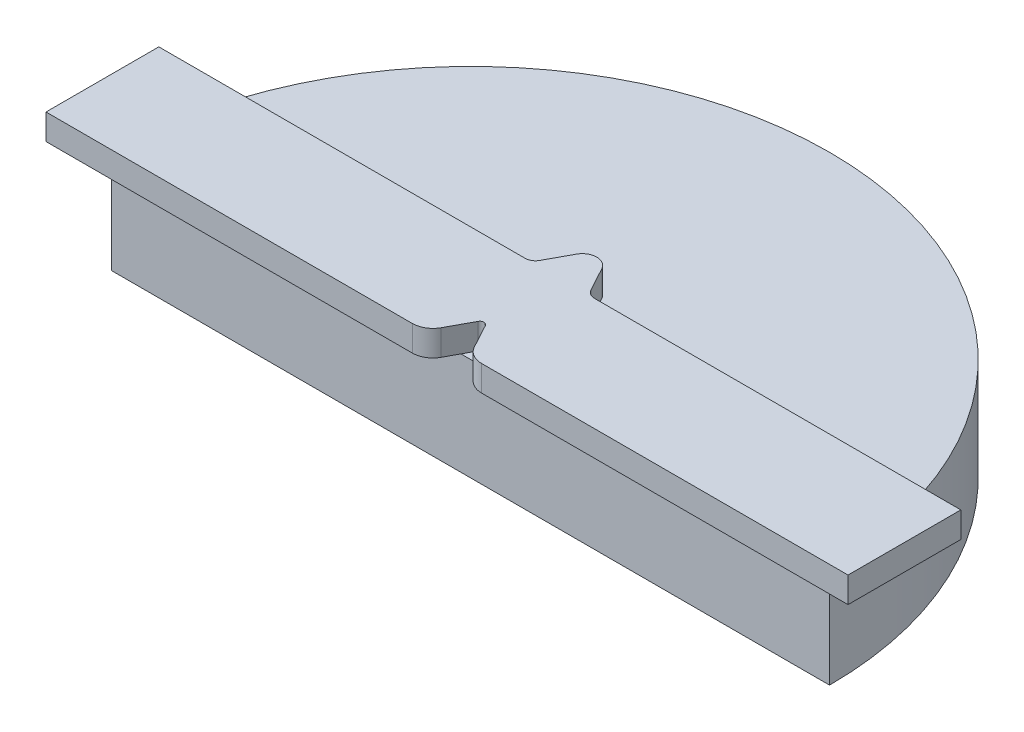
ISO-10303-21;
HEADER;
FILE_DESCRIPTION(('STEP AP214'),'2;1');
FILE_NAME('part.step','',(''),(''),'','','');
FILE_SCHEMA(('AUTOMOTIVE_DESIGN { 1 0 10303 214 1 1 1 1 }'));
ENDSEC;
DATA;
#1=APPLICATION_CONTEXT('core data for automotive mechanical design processes');
#2=APPLICATION_PROTOCOL_DEFINITION('international standard','automotive_design',2000,#1);
#3=PRODUCT_CONTEXT('',#1,'mechanical');
#4=PRODUCT('Part','Part','',(#3));
#5=PRODUCT_RELATED_PRODUCT_CATEGORY('part','',(#4));
#6=PRODUCT_DEFINITION_FORMATION('','',#4);
#7=PRODUCT_DEFINITION_CONTEXT('part definition',#1,'design');
#8=PRODUCT_DEFINITION('design','',#6,#7);
#9=PRODUCT_DEFINITION_SHAPE('','',#8);
#10=(LENGTH_UNIT() NAMED_UNIT(*) SI_UNIT(.MILLI.,.METRE.));
#11=(NAMED_UNIT(*) PLANE_ANGLE_UNIT() SI_UNIT($,.RADIAN.));
#12=(NAMED_UNIT(*) SI_UNIT($,.STERADIAN.) SOLID_ANGLE_UNIT());
#13=UNCERTAINTY_MEASURE_WITH_UNIT(LENGTH_MEASURE(1.E-05),#10,'distance_accuracy_value','');
#14=(GEOMETRIC_REPRESENTATION_CONTEXT(3) GLOBAL_UNCERTAINTY_ASSIGNED_CONTEXT((#13)) GLOBAL_UNIT_ASSIGNED_CONTEXT((#10,
#11,#12)) REPRESENTATION_CONTEXT('',''));
#15=CARTESIAN_POINT('',(0.,0.,0.));
#16=DIRECTION('',(0.,0.,1.));
#17=DIRECTION('',(1.,0.,0.));
#18=AXIS2_PLACEMENT_3D('',#15,#16,#17);
#19=CARTESIAN_POINT('',(88.9,25.4,0.));
#20=DIRECTION('',(0.,-1.,0.));
#21=DIRECTION('',(0.,0.,-1.));
#22=AXIS2_PLACEMENT_3D('',#19,#20,#21);
#23=PLANE('',#22);
#24=CARTESIAN_POINT('',(97.4834626022666,25.4,-24.638));
#25=DIRECTION('',(0.,1.,0.));
#26=DIRECTION('',(0.,0.,1.));
#27=AXIS2_PLACEMENT_3D('',#24,#25,#26);
#28=CIRCLE('',#27,2.54);
#29=CARTESIAN_POINT('',(95.2499999999999,25.4,-23.4283534382819));
#30=VERTEX_POINT('',#29);
#31=CARTESIAN_POINT('',(97.4834626022666,25.4,-22.098));
#32=VERTEX_POINT('',#31);
#33=EDGE_CURVE('E223',#30,#32,#28,.T.);
#34=ORIENTED_EDGE('',*,*,#33,.T.);
#35=DIRECTION('',(1.,0.,0.));
#36=VECTOR('',#35,1.);
#37=CARTESIAN_POINT('',(97.4834626022666,25.4,-22.098));
#38=LINE('',#37,#36);
#39=CARTESIAN_POINT('',(175.00974623119,25.4,-22.098));
#40=VERTEX_POINT('',#39);
#41=EDGE_CURVE('E220',#32,#40,#38,.T.);
#42=ORIENTED_EDGE('',*,*,#41,.T.);
#43=CARTESIAN_POINT('',(88.9,25.4,0.));
#44=DIRECTION('',(0.,1.,0.));
#45=DIRECTION('',(0.,0.,-1.));
#46=AXIS2_PLACEMENT_3D('',#43,#44,#45);
#47=CIRCLE('',#46,88.9);
#48=CARTESIAN_POINT('',(2.79025376880966,25.4,-22.098));
#49=VERTEX_POINT('',#48);
#50=EDGE_CURVE('E312',#40,#49,#47,.T.);
#51=ORIENTED_EDGE('',*,*,#50,.T.);
#52=DIRECTION('',(1.,0.,0.));
#53=VECTOR('',#52,1.);
#54=CARTESIAN_POINT('',(-10.414,25.4,-22.098));
#55=LINE('',#54,#53);
#56=CARTESIAN_POINT('',(80.3165373977333,25.4,-22.098));
#57=VERTEX_POINT('',#56);
#58=EDGE_CURVE('E202',#49,#57,#55,.T.);
#59=ORIENTED_EDGE('',*,*,#58,.T.);
#60=CARTESIAN_POINT('',(80.3165373977333,25.4,-24.638));
#61=DIRECTION('',(0.,1.,0.));
#62=DIRECTION('',(0.,0.,-1.));
#63=AXIS2_PLACEMENT_3D('',#60,#61,#62);
#64=CIRCLE('',#63,2.54);
#65=CARTESIAN_POINT('',(82.5499999999999,25.4,-23.4283534382819));
#66=VERTEX_POINT('',#65);
#67=EDGE_CURVE('E236',#57,#66,#64,.T.);
#68=ORIENTED_EDGE('',*,*,#67,.T.);
#69=DIRECTION('',(0.476238803826023,0.,-0.879315985144339));
#70=VECTOR('',#69,1.);
#71=CARTESIAN_POINT('',(85.7731523568267,25.4,-29.3795051864053));
#72=LINE('',#71,#70);
#73=CARTESIAN_POINT('',(85.7731523568267,25.4,-29.3795051864053));
#74=VERTEX_POINT('',#73);
#75=EDGE_CURVE('E233',#66,#74,#72,.T.);
#76=ORIENTED_EDGE('',*,*,#75,.T.);
#77=CARTESIAN_POINT('',(88.9,25.4,-27.686));
#78=DIRECTION('',(0.,-1.,0.));
#79=DIRECTION('',(0.,0.,1.));
#80=AXIS2_PLACEMENT_3D('',#77,#78,#79);
#81=CIRCLE('',#80,3.556);
#82=CARTESIAN_POINT('',(92.0268476431733,25.4,-29.3795051864053));
#83=VERTEX_POINT('',#82);
#84=EDGE_CURVE('E230',#74,#83,#81,.T.);
#85=ORIENTED_EDGE('',*,*,#84,.T.);
#86=DIRECTION('',(0.476238803826009,0.,0.879315985144346));
#87=VECTOR('',#86,1.);
#88=CARTESIAN_POINT('',(92.0268476431733,25.4,-29.3795051864053));
#89=LINE('',#88,#87);
#90=EDGE_CURVE('E227',#83,#30,#89,.T.);
#91=ORIENTED_EDGE('',*,*,#90,.T.);
#92=EDGE_LOOP('',(#34,#42,#51,#59,#68,#76,#85,#91));
#93=FACE_BOUND('',#92,.T.);
#94=ADVANCED_FACE('F33',(#93),#23,.F.);
#95=DIRECTION('',(0.476238803826009,0.,0.879315985144346));
#96=VECTOR('',#95,1.);
#97=CARTESIAN_POINT('',(89.7933850409066,25.4,-2.76985862468723));
#98=LINE('',#97,#96);
#99=CARTESIAN_POINT('',(89.7933850409066,25.4,-2.76985862468723));
#100=VERTEX_POINT('',#99);
#101=CARTESIAN_POINT('',(91.2935444608126,25.4,0.));
#102=VERTEX_POINT('',#101);
#103=EDGE_CURVE('E283',#100,#102,#98,.T.);
#104=ORIENTED_EDGE('',*,*,#103,.F.);
#105=CARTESIAN_POINT('',(88.9,25.4,-2.286));
#106=DIRECTION('',(0.,1.,0.));
#107=DIRECTION('',(1.,0.,0.));
#108=AXIS2_PLACEMENT_3D('',#105,#106,#107);
#109=CIRCLE('',#108,1.016);
#110=CARTESIAN_POINT('',(88.0066149590933,25.4,-2.76985862468724));
#111=VERTEX_POINT('',#110);
#112=EDGE_CURVE('E280',#111,#100,#109,.F.);
#113=ORIENTED_EDGE('',*,*,#112,.F.);
#114=DIRECTION('',(0.476238803826023,0.,-0.879315985144339));
#115=VECTOR('',#114,1.);
#116=CARTESIAN_POINT('',(88.0066149590933,25.4,-2.76985862468724));
#117=LINE('',#116,#115);
#118=CARTESIAN_POINT('',(86.5064555391873,25.4,0.));
#119=VERTEX_POINT('',#118);
#120=EDGE_CURVE('E11',#119,#111,#117,.T.);
#121=ORIENTED_EDGE('',*,*,#120,.F.);
#122=DIRECTION('',(1.,0.,0.));
#123=VECTOR('',#122,1.);
#124=CARTESIAN_POINT('',(0.,25.4,0.));
#125=LINE('',#124,#123);
#126=EDGE_CURVE('E316',#119,#102,#125,.T.);
#127=ORIENTED_EDGE('',*,*,#126,.T.);
#128=EDGE_LOOP('',(#104,#113,#121,#127));
#129=FACE_BOUND('',#128,.T.);
#130=ADVANCED_FACE('F338',(#129),#23,.F.);
#131=CARTESIAN_POINT('',(88.9,25.4,0.));
#132=DIRECTION('',(0.,-1.,0.));
#133=DIRECTION('',(0.,0.,-1.));
#134=AXIS2_PLACEMENT_3D('',#131,#132,#133);
#135=CYLINDRICAL_SURFACE('',#134,88.9);
#136=CARTESIAN_POINT('',(88.9,0.,0.));
#137=DIRECTION('',(0.,1.,0.));
#138=DIRECTION('',(0.,0.,-1.));
#139=AXIS2_PLACEMENT_3D('',#136,#137,#138);
#140=CIRCLE('',#139,88.9);
#141=CARTESIAN_POINT('',(177.8,0.,0.));
#142=VERTEX_POINT('',#141);
#143=CARTESIAN_POINT('',(0.,0.,0.));
#144=VERTEX_POINT('',#143);
#145=EDGE_CURVE('E308',#142,#144,#140,.T.);
#146=ORIENTED_EDGE('',*,*,#145,.T.);
#147=DIRECTION('',(0.,-1.,0.));
#148=VECTOR('',#147,1.);
#149=CARTESIAN_POINT('',(0.,25.4,0.));
#150=LINE('',#149,#148);
#151=CARTESIAN_POINT('',(0.,25.4,0.));
#152=VERTEX_POINT('',#151);
#153=EDGE_CURVE('E37',#152,#144,#150,.T.);
#154=ORIENTED_EDGE('',*,*,#153,.F.);
#155=CARTESIAN_POINT('',(88.9,25.4,0.));
#156=DIRECTION('',(0.,1.,0.));
#157=DIRECTION('',(0.,0.,1.));
#158=AXIS2_PLACEMENT_3D('',#155,#156,#157);
#159=CIRCLE('',#158,88.9);
#160=EDGE_CURVE('E191',#49,#152,#159,.T.);
#161=ORIENTED_EDGE('',*,*,#160,.F.);
#162=ORIENTED_EDGE('',*,*,#50,.F.);
#163=CARTESIAN_POINT('',(177.8,25.4,0.));
#164=VERTEX_POINT('',#163);
#165=EDGE_CURVE('E309',#164,#40,#47,.T.);
#166=ORIENTED_EDGE('',*,*,#165,.F.);
#167=DIRECTION('',(0.,-1.,0.));
#168=VECTOR('',#167,1.);
#169=CARTESIAN_POINT('',(177.8,25.4,0.));
#170=LINE('',#169,#168);
#171=EDGE_CURVE('E315',#164,#142,#170,.T.);
#172=ORIENTED_EDGE('',*,*,#171,.T.);
#173=EDGE_LOOP('',(#146,#154,#161,#162,#166,#172));
#174=FACE_BOUND('',#173,.T.);
#175=ADVANCED_FACE('F35',(#174),#135,.T.);
#176=CARTESIAN_POINT('',(0.,25.4,0.));
#177=DIRECTION('',(0.,0.,-1.));
#178=DIRECTION('',(-1.,0.,0.));
#179=AXIS2_PLACEMENT_3D('',#176,#177,#178);
#180=PLANE('',#179);
#181=DIRECTION('',(1.,0.,0.));
#182=VECTOR('',#181,1.);
#183=CARTESIAN_POINT('',(0.,0.,0.));
#184=LINE('',#183,#182);
#185=EDGE_CURVE('E50',#144,#142,#184,.T.);
#186=ORIENTED_EDGE('',*,*,#185,.T.);
#187=ORIENTED_EDGE('',*,*,#171,.F.);
#188=EDGE_CURVE('E311',#102,#164,#125,.T.);
#189=ORIENTED_EDGE('',*,*,#188,.F.);
#190=ORIENTED_EDGE('',*,*,#126,.F.);
#191=EDGE_CURVE('E313',#152,#119,#125,.T.);
#192=ORIENTED_EDGE('',*,*,#191,.F.);
#193=ORIENTED_EDGE('',*,*,#153,.T.);
#194=EDGE_LOOP('',(#186,#187,#189,#190,#192,#193));
#195=FACE_BOUND('',#194,.T.);
#196=ADVANCED_FACE('F323',(#195),#180,.F.);
#197=CARTESIAN_POINT('',(88.9,0.,0.));
#198=DIRECTION('',(0.,-1.,0.));
#199=DIRECTION('',(0.,0.,-1.));
#200=AXIS2_PLACEMENT_3D('',#197,#198,#199);
#201=PLANE('',#200);
#202=ORIENTED_EDGE('',*,*,#145,.F.);
#203=ORIENTED_EDGE('',*,*,#185,.F.);
#204=EDGE_LOOP('',(#202,#203));
#205=FACE_BOUND('',#204,.T.);
#206=ADVANCED_FACE('F325',(#205),#201,.T.);
#207=CARTESIAN_POINT('',(97.4834626022666,25.4,0.761999999999999));
#208=DIRECTION('',(0.,1.,0.));
#209=DIRECTION('',(1.,0.,0.));
#210=AXIS2_PLACEMENT_3D('',#207,#208,#209);
#211=PLANE('',#210);
#212=ORIENTED_EDGE('',*,*,#191,.T.);
#213=CARTESIAN_POINT('',(84.7834626022666,25.4,3.1812931234362));
#214=VERTEX_POINT('',#213);
#215=EDGE_CURVE('E43',#214,#119,#117,.T.);
#216=ORIENTED_EDGE('',*,*,#215,.F.);
#217=CARTESIAN_POINT('',(80.3165373977333,25.4,0.761999999999999));
#218=DIRECTION('',(0.,1.,0.));
#219=DIRECTION('',(1.,0.,0.));
#220=AXIS2_PLACEMENT_3D('',#217,#218,#219);
#221=CIRCLE('',#220,5.08);
#222=CARTESIAN_POINT('',(80.3165373977333,25.4,5.842));
#223=VERTEX_POINT('',#222);
#224=EDGE_CURVE('E277',#223,#214,#221,.T.);
#225=ORIENTED_EDGE('',*,*,#224,.F.);
#226=DIRECTION('',(1.,0.,0.));
#227=VECTOR('',#226,1.);
#228=CARTESIAN_POINT('',(-10.414,25.4,5.842));
#229=LINE('',#228,#227);
#230=CARTESIAN_POINT('',(-10.414,25.4,5.842));
#231=VERTEX_POINT('',#230);
#232=EDGE_CURVE('E275',#231,#223,#229,.T.);
#233=ORIENTED_EDGE('',*,*,#232,.F.);
#234=DIRECTION('',(0.,0.,-1.));
#235=VECTOR('',#234,1.);
#236=CARTESIAN_POINT('',(-10.414,25.4,5.842));
#237=LINE('',#236,#235);
#238=CARTESIAN_POINT('',(-10.414,25.4,-22.098));
#239=VERTEX_POINT('',#238);
#240=EDGE_CURVE('E273',#231,#239,#237,.T.);
#241=ORIENTED_EDGE('',*,*,#240,.T.);
#242=EDGE_CURVE('E197',#239,#49,#55,.T.);
#243=ORIENTED_EDGE('',*,*,#242,.T.);
#244=ORIENTED_EDGE('',*,*,#160,.T.);
#245=EDGE_LOOP('',(#212,#216,#225,#233,#241,#243,#244));
#246=FACE_BOUND('',#245,.T.);
#247=ADVANCED_FACE('F327',(#246),#211,.F.);
#248=DIRECTION('',(0.,0.,1.));
#249=VECTOR('',#248,1.);
#250=CARTESIAN_POINT('',(188.214,25.4,3.302));
#251=LINE('',#250,#249);
#252=CARTESIAN_POINT('',(188.214,25.4,-22.098));
#253=VERTEX_POINT('',#252);
#254=CARTESIAN_POINT('',(188.214,25.4,5.842));
#255=VERTEX_POINT('',#254);
#256=EDGE_CURVE('E187',#253,#255,#251,.T.);
#257=ORIENTED_EDGE('',*,*,#256,.T.);
#258=DIRECTION('',(1.,0.,0.));
#259=VECTOR('',#258,1.);
#260=CARTESIAN_POINT('',(97.4834626022666,25.4,5.842));
#261=LINE('',#260,#259);
#262=CARTESIAN_POINT('',(97.4834626022666,25.4,5.842));
#263=VERTEX_POINT('',#262);
#264=EDGE_CURVE('E253',#263,#255,#261,.T.);
#265=ORIENTED_EDGE('',*,*,#264,.F.);
#266=CARTESIAN_POINT('',(97.4834626022666,25.4,0.761999999999999));
#267=DIRECTION('',(0.,1.,0.));
#268=DIRECTION('',(1.,0.,0.));
#269=AXIS2_PLACEMENT_3D('',#266,#267,#268);
#270=CIRCLE('',#269,5.08);
#271=CARTESIAN_POINT('',(93.0165373977333,25.4,3.18129312343612));
#272=VERTEX_POINT('',#271);
#273=EDGE_CURVE('E254',#272,#263,#270,.T.);
#274=ORIENTED_EDGE('',*,*,#273,.F.);
#275=EDGE_CURVE('E282',#102,#272,#98,.T.);
#276=ORIENTED_EDGE('',*,*,#275,.F.);
#277=ORIENTED_EDGE('',*,*,#188,.T.);
#278=ORIENTED_EDGE('',*,*,#165,.T.);
#279=EDGE_CURVE('E224',#40,#253,#38,.T.);
#280=ORIENTED_EDGE('',*,*,#279,.T.);
#281=EDGE_LOOP('',(#257,#265,#274,#276,#277,#278,#280));
#282=FACE_BOUND('',#281,.T.);
#283=ADVANCED_FACE('F333',(#282),#211,.F.);
#284=CARTESIAN_POINT('',(97.4834626022666,31.75,5.842));
#285=DIRECTION('',(0.,0.,-1.));
#286=DIRECTION('',(-1.,0.,0.));
#287=AXIS2_PLACEMENT_3D('',#284,#285,#286);
#288=PLANE('',#287);
#289=ORIENTED_EDGE('',*,*,#264,.T.);
#290=DIRECTION('',(0.,-1.,0.));
#291=VECTOR('',#290,1.);
#292=CARTESIAN_POINT('',(188.214,31.75,5.842));
#293=LINE('',#292,#291);
#294=CARTESIAN_POINT('',(188.214,31.75,5.842));
#295=VERTEX_POINT('',#294);
#296=EDGE_CURVE('E306',#295,#255,#293,.T.);
#297=ORIENTED_EDGE('',*,*,#296,.F.);
#298=DIRECTION('',(1.,0.,0.));
#299=VECTOR('',#298,1.);
#300=CARTESIAN_POINT('',(97.4834626022666,31.75,5.842));
#301=LINE('',#300,#299);
#302=CARTESIAN_POINT('',(97.4834626022666,31.75,5.842));
#303=VERTEX_POINT('',#302);
#304=EDGE_CURVE('E178',#303,#295,#301,.T.);
#305=ORIENTED_EDGE('',*,*,#304,.F.);
#306=DIRECTION('',(0.,-1.,0.));
#307=VECTOR('',#306,1.);
#308=CARTESIAN_POINT('',(97.4834626022666,31.75,5.842));
#309=LINE('',#308,#307);
#310=EDGE_CURVE('E269',#303,#263,#309,.T.);
#311=ORIENTED_EDGE('',*,*,#310,.T.);
#312=EDGE_LOOP('',(#289,#297,#305,#311));
#313=FACE_BOUND('',#312,.T.);
#314=ADVANCED_FACE('F345',(#313),#288,.F.);
#315=CARTESIAN_POINT('',(188.214,31.75,3.302));
#316=DIRECTION('',(1.,0.,0.));
#317=DIRECTION('',(0.,0.,-1.));
#318=AXIS2_PLACEMENT_3D('',#315,#316,#317);
#319=PLANE('',#318);
#320=DIRECTION('',(0.,0.,1.));
#321=VECTOR('',#320,1.);
#322=CARTESIAN_POINT('',(188.214,31.75,3.302));
#323=LINE('',#322,#321);
#324=CARTESIAN_POINT('',(188.214,31.75,-22.098));
#325=VERTEX_POINT('',#324);
#326=EDGE_CURVE('E170',#325,#295,#323,.T.);
#327=ORIENTED_EDGE('',*,*,#326,.T.);
#328=ORIENTED_EDGE('',*,*,#296,.T.);
#329=ORIENTED_EDGE('',*,*,#256,.F.);
#330=DIRECTION('',(0.,-1.,0.));
#331=VECTOR('',#330,1.);
#332=CARTESIAN_POINT('',(188.214,31.75,-22.098));
#333=LINE('',#332,#331);
#334=EDGE_CURVE('E185',#325,#253,#333,.T.);
#335=ORIENTED_EDGE('',*,*,#334,.F.);
#336=EDGE_LOOP('',(#327,#328,#329,#335));
#337=FACE_BOUND('',#336,.T.);
#338=ADVANCED_FACE('F186',(#337),#319,.T.);
#339=CARTESIAN_POINT('',(-10.414,31.75,5.842));
#340=DIRECTION('',(-1.,0.,0.));
#341=DIRECTION('',(0.,0.,1.));
#342=AXIS2_PLACEMENT_3D('',#339,#340,#341);
#343=PLANE('',#342);
#344=DIRECTION('',(0.,-1.,0.));
#345=VECTOR('',#344,1.);
#346=CARTESIAN_POINT('',(-10.414,31.75,-22.098));
#347=LINE('',#346,#345);
#348=CARTESIAN_POINT('',(-10.414,31.75,-22.098));
#349=VERTEX_POINT('',#348);
#350=EDGE_CURVE('E219',#349,#239,#347,.T.);
#351=ORIENTED_EDGE('',*,*,#350,.T.);
#352=ORIENTED_EDGE('',*,*,#240,.F.);
#353=DIRECTION('',(0.,-1.,0.));
#354=VECTOR('',#353,1.);
#355=CARTESIAN_POINT('',(-10.414,31.75,5.842));
#356=LINE('',#355,#354);
#357=CARTESIAN_POINT('',(-10.414,31.75,5.842));
#358=VERTEX_POINT('',#357);
#359=EDGE_CURVE('E304',#358,#231,#356,.T.);
#360=ORIENTED_EDGE('',*,*,#359,.F.);
#361=DIRECTION('',(0.,0.,-1.));
#362=VECTOR('',#361,1.);
#363=CARTESIAN_POINT('',(-10.414,31.75,5.842));
#364=LINE('',#363,#362);
#365=EDGE_CURVE('E182',#358,#349,#364,.T.);
#366=ORIENTED_EDGE('',*,*,#365,.T.);
#367=EDGE_LOOP('',(#351,#352,#360,#366));
#368=FACE_BOUND('',#367,.T.);
#369=ADVANCED_FACE('F351',(#368),#343,.T.);
#370=CARTESIAN_POINT('',(-10.414,31.75,5.842));
#371=DIRECTION('',(0.,0.,-1.));
#372=DIRECTION('',(-1.,0.,0.));
#373=AXIS2_PLACEMENT_3D('',#370,#371,#372);
#374=PLANE('',#373);
#375=ORIENTED_EDGE('',*,*,#232,.T.);
#376=DIRECTION('',(0.,-1.,0.));
#377=VECTOR('',#376,1.);
#378=CARTESIAN_POINT('',(80.3165373977333,31.75,5.842));
#379=LINE('',#378,#377);
#380=CARTESIAN_POINT('',(80.3165373977333,31.75,5.842));
#381=VERTEX_POINT('',#380);
#382=EDGE_CURVE('E301',#381,#223,#379,.T.);
#383=ORIENTED_EDGE('',*,*,#382,.F.);
#384=DIRECTION('',(1.,0.,0.));
#385=VECTOR('',#384,1.);
#386=CARTESIAN_POINT('',(-10.414,31.75,5.842));
#387=LINE('',#386,#385);
#388=EDGE_CURVE('E257',#358,#381,#387,.T.);
#389=ORIENTED_EDGE('',*,*,#388,.F.);
#390=ORIENTED_EDGE('',*,*,#359,.T.);
#391=EDGE_LOOP('',(#375,#383,#389,#390));
#392=FACE_BOUND('',#391,.T.);
#393=ADVANCED_FACE('F354',(#392),#374,.F.);
#394=CARTESIAN_POINT('',(80.3165373977333,31.75,0.761999999999999));
#395=DIRECTION('',(0.,-1.,0.));
#396=DIRECTION('',(0.,0.,-1.));
#397=AXIS2_PLACEMENT_3D('',#394,#395,#396);
#398=CYLINDRICAL_SURFACE('',#397,5.08);
#399=ORIENTED_EDGE('',*,*,#224,.T.);
#400=DIRECTION('',(0.,-1.,0.));
#401=VECTOR('',#400,1.);
#402=CARTESIAN_POINT('',(84.7834626022666,31.75,3.1812931234362));
#403=LINE('',#402,#401);
#404=CARTESIAN_POINT('',(84.7834626022666,31.75,3.1812931234362));
#405=VERTEX_POINT('',#404);
#406=EDGE_CURVE('E298',#405,#214,#403,.T.);
#407=ORIENTED_EDGE('',*,*,#406,.F.);
#408=CARTESIAN_POINT('',(80.3165373977333,31.75,0.761999999999999));
#409=DIRECTION('',(0.,1.,0.));
#410=DIRECTION('',(1.,0.,0.));
#411=AXIS2_PLACEMENT_3D('',#408,#409,#410);
#412=CIRCLE('',#411,5.08);
#413=EDGE_CURVE('E259',#381,#405,#412,.T.);
#414=ORIENTED_EDGE('',*,*,#413,.F.);
#415=ORIENTED_EDGE('',*,*,#382,.T.);
#416=EDGE_LOOP('',(#399,#407,#414,#415));
#417=FACE_BOUND('',#416,.T.);
#418=ADVANCED_FACE('F358',(#417),#398,.T.);
#419=CARTESIAN_POINT('',(88.0066149590933,31.75,-2.76985862468724));
#420=DIRECTION('',(-0.879315985144339,0.,-0.476238803826023));
#421=DIRECTION('',(-0.476238803826023,0.,0.879315985144339));
#422=AXIS2_PLACEMENT_3D('',#419,#420,#421);
#423=PLANE('',#422);
#424=ORIENTED_EDGE('',*,*,#215,.T.);
#425=ORIENTED_EDGE('',*,*,#120,.T.);
#426=DIRECTION('',(0.,-1.,0.));
#427=VECTOR('',#426,1.);
#428=CARTESIAN_POINT('',(88.0066149590933,31.75,-2.76985862468724));
#429=LINE('',#428,#427);
#430=CARTESIAN_POINT('',(88.0066149590933,31.75,-2.76985862468724));
#431=VERTEX_POINT('',#430);
#432=EDGE_CURVE('E295',#431,#111,#429,.T.);
#433=ORIENTED_EDGE('',*,*,#432,.F.);
#434=DIRECTION('',(0.476238803826023,0.,-0.879315985144339));
#435=VECTOR('',#434,1.);
#436=CARTESIAN_POINT('',(88.0066149590933,31.75,-2.76985862468724));
#437=LINE('',#436,#435);
#438=EDGE_CURVE('E261',#405,#431,#437,.T.);
#439=ORIENTED_EDGE('',*,*,#438,.F.);
#440=ORIENTED_EDGE('',*,*,#406,.T.);
#441=EDGE_LOOP('',(#424,#425,#433,#439,#440));
#442=FACE_BOUND('',#441,.T.);
#443=ADVANCED_FACE('F362',(#442),#423,.F.);
#444=CARTESIAN_POINT('',(88.9,31.75,-2.286));
#445=DIRECTION('',(0.,-1.,0.));
#446=DIRECTION('',(0.,0.,-1.));
#447=AXIS2_PLACEMENT_3D('',#444,#445,#446);
#448=CYLINDRICAL_SURFACE('',#447,1.016);
#449=ORIENTED_EDGE('',*,*,#112,.T.);
#450=DIRECTION('',(0.,-1.,0.));
#451=VECTOR('',#450,1.);
#452=CARTESIAN_POINT('',(89.7933850409066,31.75,-2.76985862468723));
#453=LINE('',#452,#451);
#454=CARTESIAN_POINT('',(89.7933850409066,31.75,-2.76985862468723));
#455=VERTEX_POINT('',#454);
#456=EDGE_CURVE('E292',#455,#100,#453,.T.);
#457=ORIENTED_EDGE('',*,*,#456,.F.);
#458=CARTESIAN_POINT('',(88.9,31.75,-2.286));
#459=DIRECTION('',(0.,1.,0.));
#460=DIRECTION('',(1.,0.,0.));
#461=AXIS2_PLACEMENT_3D('',#458,#459,#460);
#462=CIRCLE('',#461,1.016);
#463=EDGE_CURVE('E263',#431,#455,#462,.F.);
#464=ORIENTED_EDGE('',*,*,#463,.F.);
#465=ORIENTED_EDGE('',*,*,#432,.T.);
#466=EDGE_LOOP('',(#449,#457,#464,#465));
#467=FACE_BOUND('',#466,.T.);
#468=ADVANCED_FACE('F366',(#467),#448,.F.);
#469=CARTESIAN_POINT('',(89.7933850409066,31.75,-2.76985862468723));
#470=DIRECTION('',(0.879315985144346,0.,-0.476238803826009));
#471=DIRECTION('',(-0.476238803826009,0.,-0.879315985144346));
#472=AXIS2_PLACEMENT_3D('',#469,#470,#471);
#473=PLANE('',#472);
#474=ORIENTED_EDGE('',*,*,#103,.T.);
#475=ORIENTED_EDGE('',*,*,#275,.T.);
#476=DIRECTION('',(0.,-1.,0.));
#477=VECTOR('',#476,1.);
#478=CARTESIAN_POINT('',(93.0165373977333,31.75,3.18129312343612));
#479=LINE('',#478,#477);
#480=CARTESIAN_POINT('',(93.0165373977333,31.75,3.18129312343612));
#481=VERTEX_POINT('',#480);
#482=EDGE_CURVE('E289',#481,#272,#479,.T.);
#483=ORIENTED_EDGE('',*,*,#482,.F.);
#484=DIRECTION('',(0.476238803826009,0.,0.879315985144346));
#485=VECTOR('',#484,1.);
#486=CARTESIAN_POINT('',(89.7933850409066,31.75,-2.76985862468723));
#487=LINE('',#486,#485);
#488=EDGE_CURVE('E265',#455,#481,#487,.T.);
#489=ORIENTED_EDGE('',*,*,#488,.F.);
#490=ORIENTED_EDGE('',*,*,#456,.T.);
#491=EDGE_LOOP('',(#474,#475,#483,#489,#490));
#492=FACE_BOUND('',#491,.T.);
#493=ADVANCED_FACE('F370',(#492),#473,.F.);
#494=CARTESIAN_POINT('',(97.4834626022666,31.75,0.761999999999999));
#495=DIRECTION('',(0.,-1.,0.));
#496=DIRECTION('',(0.,0.,-1.));
#497=AXIS2_PLACEMENT_3D('',#494,#495,#496);
#498=CYLINDRICAL_SURFACE('',#497,5.08);
#499=ORIENTED_EDGE('',*,*,#273,.T.);
#500=ORIENTED_EDGE('',*,*,#310,.F.);
#501=CARTESIAN_POINT('',(97.4834626022666,31.75,0.761999999999999));
#502=DIRECTION('',(0.,1.,0.));
#503=DIRECTION('',(1.,0.,0.));
#504=AXIS2_PLACEMENT_3D('',#501,#502,#503);
#505=CIRCLE('',#504,5.08);
#506=EDGE_CURVE('E267',#481,#303,#505,.T.);
#507=ORIENTED_EDGE('',*,*,#506,.F.);
#508=ORIENTED_EDGE('',*,*,#482,.T.);
#509=EDGE_LOOP('',(#499,#500,#507,#508));
#510=FACE_BOUND('',#509,.T.);
#511=ADVANCED_FACE('F374',(#510),#498,.T.);
#512=CARTESIAN_POINT('',(97.4834626022666,31.75,0.761999999999999));
#513=DIRECTION('',(0.,1.,0.));
#514=DIRECTION('',(1.,0.,0.));
#515=AXIS2_PLACEMENT_3D('',#512,#513,#514);
#516=PLANE('',#515);
#517=ORIENTED_EDGE('',*,*,#304,.T.);
#518=ORIENTED_EDGE('',*,*,#326,.F.);
#519=DIRECTION('',(1.,0.,0.));
#520=VECTOR('',#519,1.);
#521=CARTESIAN_POINT('',(97.4834626022666,31.75,-22.098));
#522=LINE('',#521,#520);
#523=CARTESIAN_POINT('',(97.4834626022666,31.75,-22.098));
#524=VERTEX_POINT('',#523);
#525=EDGE_CURVE('E175',#524,#325,#522,.T.);
#526=ORIENTED_EDGE('',*,*,#525,.F.);
#527=CARTESIAN_POINT('',(97.4834626022666,31.75,-24.638));
#528=DIRECTION('',(0.,1.,0.));
#529=DIRECTION('',(0.,0.,1.));
#530=AXIS2_PLACEMENT_3D('',#527,#528,#529);
#531=CIRCLE('',#530,2.54);
#532=CARTESIAN_POINT('',(95.2499999999999,31.75,-23.4283534382819));
#533=VERTEX_POINT('',#532);
#534=EDGE_CURVE('E196',#533,#524,#531,.T.);
#535=ORIENTED_EDGE('',*,*,#534,.F.);
#536=DIRECTION('',(0.476238803826009,0.,0.879315985144346));
#537=VECTOR('',#536,1.);
#538=CARTESIAN_POINT('',(92.0268476431733,31.75,-29.3795051864053));
#539=LINE('',#538,#537);
#540=CARTESIAN_POINT('',(92.0268476431733,31.75,-29.3795051864053));
#541=VERTEX_POINT('',#540);
#542=EDGE_CURVE('E199',#541,#533,#539,.T.);
#543=ORIENTED_EDGE('',*,*,#542,.F.);
#544=CARTESIAN_POINT('',(88.9,31.75,-27.686));
#545=DIRECTION('',(0.,-1.,0.));
#546=DIRECTION('',(0.,0.,1.));
#547=AXIS2_PLACEMENT_3D('',#544,#545,#546);
#548=CIRCLE('',#547,3.556);
#549=CARTESIAN_POINT('',(85.7731523568267,31.75,-29.3795051864053));
#550=VERTEX_POINT('',#549);
#551=EDGE_CURVE('E207',#550,#541,#548,.T.);
#552=ORIENTED_EDGE('',*,*,#551,.F.);
#553=DIRECTION('',(0.476238803826023,0.,-0.879315985144339));
#554=VECTOR('',#553,1.);
#555=CARTESIAN_POINT('',(85.7731523568267,31.75,-29.3795051864053));
#556=LINE('',#555,#554);
#557=CARTESIAN_POINT('',(82.5499999999999,31.75,-23.4283534382819));
#558=VERTEX_POINT('',#557);
#559=EDGE_CURVE('E210',#558,#550,#556,.T.);
#560=ORIENTED_EDGE('',*,*,#559,.F.);
#561=CARTESIAN_POINT('',(80.3165373977333,31.75,-24.638));
#562=DIRECTION('',(0.,1.,0.));
#563=DIRECTION('',(0.,0.,-1.));
#564=AXIS2_PLACEMENT_3D('',#561,#562,#563);
#565=CIRCLE('',#564,2.54);
#566=CARTESIAN_POINT('',(80.3165373977333,31.75,-22.098));
#567=VERTEX_POINT('',#566);
#568=EDGE_CURVE('E213',#567,#558,#565,.T.);
#569=ORIENTED_EDGE('',*,*,#568,.F.);
#570=DIRECTION('',(1.,0.,0.));
#571=VECTOR('',#570,1.);
#572=CARTESIAN_POINT('',(-10.414,31.75,-22.098));
#573=LINE('',#572,#571);
#574=EDGE_CURVE('E216',#349,#567,#573,.T.);
#575=ORIENTED_EDGE('',*,*,#574,.F.);
#576=ORIENTED_EDGE('',*,*,#365,.F.);
#577=ORIENTED_EDGE('',*,*,#388,.T.);
#578=ORIENTED_EDGE('',*,*,#413,.T.);
#579=ORIENTED_EDGE('',*,*,#438,.T.);
#580=ORIENTED_EDGE('',*,*,#463,.T.);
#581=ORIENTED_EDGE('',*,*,#488,.T.);
#582=ORIENTED_EDGE('',*,*,#506,.T.);
#583=EDGE_LOOP('',(#517,#518,#526,#535,#543,#552,#560,#569,#575,#576,#577,#578,#579,#580,#581,#582));
#584=FACE_BOUND('',#583,.T.);
#585=ADVANCED_FACE('F172',(#584),#516,.T.);
#586=CARTESIAN_POINT('',(97.4834626022666,31.75,-22.098));
#587=DIRECTION('',(0.,0.,-1.));
#588=DIRECTION('',(-1.,0.,0.));
#589=AXIS2_PLACEMENT_3D('',#586,#587,#588);
#590=PLANE('',#589);
#591=ORIENTED_EDGE('',*,*,#41,.F.);
#592=DIRECTION('',(0.,-1.,0.));
#593=VECTOR('',#592,1.);
#594=CARTESIAN_POINT('',(97.4834626022666,31.75,-22.098));
#595=LINE('',#594,#593);
#596=EDGE_CURVE('E192',#524,#32,#595,.T.);
#597=ORIENTED_EDGE('',*,*,#596,.F.);
#598=ORIENTED_EDGE('',*,*,#525,.T.);
#599=ORIENTED_EDGE('',*,*,#334,.T.);
#600=ORIENTED_EDGE('',*,*,#279,.F.);
#601=EDGE_LOOP('',(#591,#597,#598,#599,#600));
#602=FACE_BOUND('',#601,.T.);
#603=ADVANCED_FACE('F195',(#602),#590,.T.);
#604=CARTESIAN_POINT('',(97.4834626022666,31.75,-24.638));
#605=DIRECTION('',(0.,-1.,0.));
#606=DIRECTION('',(0.,0.,-1.));
#607=AXIS2_PLACEMENT_3D('',#604,#605,#606);
#608=CYLINDRICAL_SURFACE('',#607,2.54);
#609=ORIENTED_EDGE('',*,*,#33,.F.);
#610=DIRECTION('',(0.,-1.,0.));
#611=VECTOR('',#610,1.);
#612=CARTESIAN_POINT('',(95.2499999999999,31.75,-23.4283534382819));
#613=LINE('',#612,#611);
#614=EDGE_CURVE('E249',#533,#30,#613,.T.);
#615=ORIENTED_EDGE('',*,*,#614,.F.);
#616=ORIENTED_EDGE('',*,*,#534,.T.);
#617=ORIENTED_EDGE('',*,*,#596,.T.);
#618=EDGE_LOOP('',(#609,#615,#616,#617));
#619=FACE_BOUND('',#618,.T.);
#620=ADVANCED_FACE('F383',(#619),#608,.F.);
#621=CARTESIAN_POINT('',(92.0268476431733,31.75,-29.3795051864053));
#622=DIRECTION('',(0.879315985144346,0.,-0.476238803826009));
#623=DIRECTION('',(-0.476238803826009,0.,-0.879315985144346));
#624=AXIS2_PLACEMENT_3D('',#621,#622,#623);
#625=PLANE('',#624);
#626=ORIENTED_EDGE('',*,*,#90,.F.);
#627=DIRECTION('',(0.,-1.,0.));
#628=VECTOR('',#627,1.);
#629=CARTESIAN_POINT('',(92.0268476431733,31.75,-29.3795051864053));
#630=LINE('',#629,#628);
#631=EDGE_CURVE('E247',#541,#83,#630,.T.);
#632=ORIENTED_EDGE('',*,*,#631,.F.);
#633=ORIENTED_EDGE('',*,*,#542,.T.);
#634=ORIENTED_EDGE('',*,*,#614,.T.);
#635=EDGE_LOOP('',(#626,#632,#633,#634));
#636=FACE_BOUND('',#635,.T.);
#637=ADVANCED_FACE('F386',(#636),#625,.T.);
#638=CARTESIAN_POINT('',(88.9,31.75,-27.686));
#639=DIRECTION('',(0.,-1.,0.));
#640=DIRECTION('',(0.,0.,-1.));
#641=AXIS2_PLACEMENT_3D('',#638,#639,#640);
#642=CYLINDRICAL_SURFACE('',#641,3.556);
#643=ORIENTED_EDGE('',*,*,#84,.F.);
#644=DIRECTION('',(0.,-1.,0.));
#645=VECTOR('',#644,1.);
#646=CARTESIAN_POINT('',(85.7731523568267,31.75,-29.3795051864053));
#647=LINE('',#646,#645);
#648=EDGE_CURVE('E245',#550,#74,#647,.T.);
#649=ORIENTED_EDGE('',*,*,#648,.F.);
#650=ORIENTED_EDGE('',*,*,#551,.T.);
#651=ORIENTED_EDGE('',*,*,#631,.T.);
#652=EDGE_LOOP('',(#643,#649,#650,#651));
#653=FACE_BOUND('',#652,.T.);
#654=ADVANCED_FACE('F390',(#653),#642,.T.);
#655=CARTESIAN_POINT('',(85.7731523568267,31.75,-29.3795051864053));
#656=DIRECTION('',(-0.879315985144339,0.,-0.476238803826023));
#657=DIRECTION('',(-0.476238803826023,0.,0.879315985144339));
#658=AXIS2_PLACEMENT_3D('',#655,#656,#657);
#659=PLANE('',#658);
#660=ORIENTED_EDGE('',*,*,#75,.F.);
#661=DIRECTION('',(0.,-1.,0.));
#662=VECTOR('',#661,1.);
#663=CARTESIAN_POINT('',(82.5499999999999,31.75,-23.4283534382819));
#664=LINE('',#663,#662);
#665=EDGE_CURVE('E243',#558,#66,#664,.T.);
#666=ORIENTED_EDGE('',*,*,#665,.F.);
#667=ORIENTED_EDGE('',*,*,#559,.T.);
#668=ORIENTED_EDGE('',*,*,#648,.T.);
#669=EDGE_LOOP('',(#660,#666,#667,#668));
#670=FACE_BOUND('',#669,.T.);
#671=ADVANCED_FACE('F394',(#670),#659,.T.);
#672=CARTESIAN_POINT('',(80.3165373977333,31.75,-24.638));
#673=DIRECTION('',(0.,-1.,0.));
#674=DIRECTION('',(0.,0.,-1.));
#675=AXIS2_PLACEMENT_3D('',#672,#673,#674);
#676=CYLINDRICAL_SURFACE('',#675,2.54);
#677=ORIENTED_EDGE('',*,*,#67,.F.);
#678=DIRECTION('',(0.,-1.,0.));
#679=VECTOR('',#678,1.);
#680=CARTESIAN_POINT('',(80.3165373977333,31.75,-22.098));
#681=LINE('',#680,#679);
#682=EDGE_CURVE('E241',#567,#57,#681,.T.);
#683=ORIENTED_EDGE('',*,*,#682,.F.);
#684=ORIENTED_EDGE('',*,*,#568,.T.);
#685=ORIENTED_EDGE('',*,*,#665,.T.);
#686=EDGE_LOOP('',(#677,#683,#684,#685));
#687=FACE_BOUND('',#686,.T.);
#688=ADVANCED_FACE('F398',(#687),#676,.F.);
#689=CARTESIAN_POINT('',(-10.414,31.75,-22.098));
#690=DIRECTION('',(0.,0.,-1.));
#691=DIRECTION('',(-1.,0.,0.));
#692=AXIS2_PLACEMENT_3D('',#689,#690,#691);
#693=PLANE('',#692);
#694=ORIENTED_EDGE('',*,*,#242,.F.);
#695=ORIENTED_EDGE('',*,*,#350,.F.);
#696=ORIENTED_EDGE('',*,*,#574,.T.);
#697=ORIENTED_EDGE('',*,*,#682,.T.);
#698=ORIENTED_EDGE('',*,*,#58,.F.);
#699=EDGE_LOOP('',(#694,#695,#696,#697,#698));
#700=FACE_BOUND('',#699,.T.);
#701=ADVANCED_FACE('F402',(#700),#693,.T.);
#702=CLOSED_SHELL('',(#94,#130,#175,#196,#206,#247,#283,#314,#338,#369,#393,#418,#443,#468,#493,
#511,#585,#603,#620,#637,#654,#671,#688,#701));
#703=MANIFOLD_SOLID_BREP('B2',#702);
#704=ADVANCED_BREP_SHAPE_REPRESENTATION('',(#18,#703),#14);
#705=SHAPE_DEFINITION_REPRESENTATION(#9,#704);
ENDSEC;
END-ISO-10303-21;
